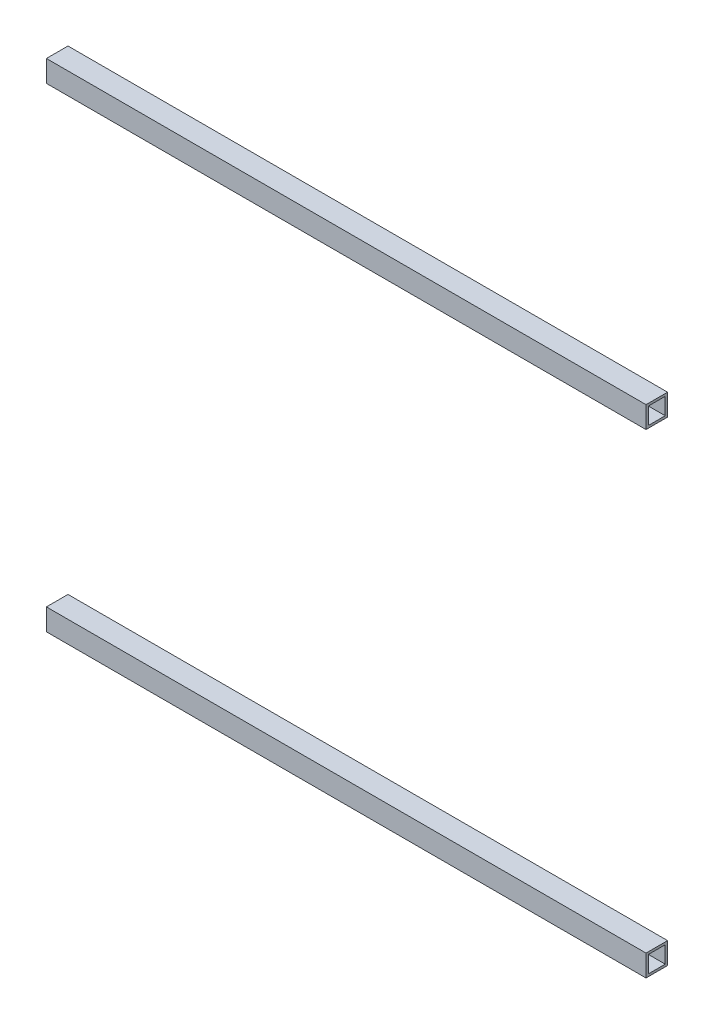
ISO-10303-21;
HEADER;
FILE_DESCRIPTION(('STEP AP214'),'2;1');
FILE_NAME('part.step','',(''),(''),'','','');
FILE_SCHEMA(('AUTOMOTIVE_DESIGN { 1 0 10303 214 1 1 1 1 }'));
ENDSEC;
DATA;
#1=APPLICATION_CONTEXT('core data for automotive mechanical design processes');
#2=APPLICATION_PROTOCOL_DEFINITION('international standard','automotive_design',2000,#1);
#3=PRODUCT_CONTEXT('',#1,'mechanical');
#4=PRODUCT('Part','Part','',(#3));
#5=PRODUCT_RELATED_PRODUCT_CATEGORY('part','',(#4));
#6=PRODUCT_DEFINITION_FORMATION('','',#4);
#7=PRODUCT_DEFINITION_CONTEXT('part definition',#1,'design');
#8=PRODUCT_DEFINITION('design','',#6,#7);
#9=PRODUCT_DEFINITION_SHAPE('','',#8);
#10=(LENGTH_UNIT() NAMED_UNIT(*) SI_UNIT(.MILLI.,.METRE.));
#11=(NAMED_UNIT(*) PLANE_ANGLE_UNIT() SI_UNIT($,.RADIAN.));
#12=(NAMED_UNIT(*) SI_UNIT($,.STERADIAN.) SOLID_ANGLE_UNIT());
#13=UNCERTAINTY_MEASURE_WITH_UNIT(LENGTH_MEASURE(1.E-05),#10,'distance_accuracy_value','');
#14=(GEOMETRIC_REPRESENTATION_CONTEXT(3) GLOBAL_UNCERTAINTY_ASSIGNED_CONTEXT((#13)) GLOBAL_UNIT_ASSIGNED_CONTEXT((#10,
#11,#12)) REPRESENTATION_CONTEXT('',''));
#15=CARTESIAN_POINT('',(0.,0.,0.));
#16=DIRECTION('',(0.,0.,1.));
#17=DIRECTION('',(1.,0.,0.));
#18=AXIS2_PLACEMENT_3D('',#15,#16,#17);
#19=CARTESIAN_POINT('',(529.05,9.52500000000001,9.52500000000002));
#20=DIRECTION('',(0.,-1.,0.));
#21=DIRECTION('',(0.,0.,-1.));
#22=AXIS2_PLACEMENT_3D('',#19,#20,#21);
#23=PLANE('',#22);
#24=DIRECTION('',(0.,0.,1.));
#25=VECTOR('',#24,1.);
#26=CARTESIAN_POINT('',(0.,9.52500000000001,9.52500000000002));
#27=LINE('',#26,#25);
#28=CARTESIAN_POINT('',(0.,9.52500000000001,-9.52500000000003));
#29=VERTEX_POINT('',#28);
#30=CARTESIAN_POINT('',(0.,9.52500000000001,9.52500000000002));
#31=VERTEX_POINT('',#30);
#32=EDGE_CURVE('E171',#29,#31,#27,.T.);
#33=ORIENTED_EDGE('',*,*,#32,.T.);
#34=DIRECTION('',(-1.,0.,0.));
#35=VECTOR('',#34,1.);
#36=CARTESIAN_POINT('',(529.05,9.52500000000001,9.52500000000002));
#37=LINE('',#36,#35);
#38=CARTESIAN_POINT('',(529.05,9.52500000000001,9.52500000000002));
#39=VERTEX_POINT('',#38);
#40=EDGE_CURVE('E13',#39,#31,#37,.T.);
#41=ORIENTED_EDGE('',*,*,#40,.F.);
#42=DIRECTION('',(0.,0.,1.));
#43=VECTOR('',#42,1.);
#44=CARTESIAN_POINT('',(529.05,9.52500000000001,9.52500000000002));
#45=LINE('',#44,#43);
#46=CARTESIAN_POINT('',(529.05,9.52500000000001,-9.52500000000003));
#47=VERTEX_POINT('',#46);
#48=EDGE_CURVE('E145',#47,#39,#45,.T.);
#49=ORIENTED_EDGE('',*,*,#48,.F.);
#50=DIRECTION('',(-1.,0.,0.));
#51=VECTOR('',#50,1.);
#52=CARTESIAN_POINT('',(529.05,9.52500000000001,-9.52500000000003));
#53=LINE('',#52,#51);
#54=EDGE_CURVE('E178',#47,#29,#53,.T.);
#55=ORIENTED_EDGE('',*,*,#54,.T.);
#56=EDGE_LOOP('',(#33,#41,#49,#55));
#57=FACE_BOUND('',#56,.T.);
#58=ADVANCED_FACE('F64',(#57),#23,.F.);
#59=CARTESIAN_POINT('',(529.05,9.52500000000001,9.52500000000002));
#60=DIRECTION('',(0.,0.,-1.));
#61=DIRECTION('',(-1.,0.,0.));
#62=AXIS2_PLACEMENT_3D('',#59,#60,#61);
#63=PLANE('',#62);
#64=DIRECTION('',(0.,-1.,0.));
#65=VECTOR('',#64,1.);
#66=CARTESIAN_POINT('',(0.,9.52500000000001,9.52500000000002));
#67=LINE('',#66,#65);
#68=CARTESIAN_POINT('',(0.,-9.52500000000001,9.52500000000002));
#69=VERTEX_POINT('',#68);
#70=EDGE_CURVE('E150',#31,#69,#67,.T.);
#71=ORIENTED_EDGE('',*,*,#70,.T.);
#72=DIRECTION('',(-1.,0.,0.));
#73=VECTOR('',#72,1.);
#74=CARTESIAN_POINT('',(529.05,-9.52500000000001,9.52500000000002));
#75=LINE('',#74,#73);
#76=CARTESIAN_POINT('',(529.05,-9.52500000000001,9.52500000000002));
#77=VERTEX_POINT('',#76);
#78=EDGE_CURVE('E74',#77,#69,#75,.T.);
#79=ORIENTED_EDGE('',*,*,#78,.F.);
#80=DIRECTION('',(0.,-1.,0.));
#81=VECTOR('',#80,1.);
#82=CARTESIAN_POINT('',(529.05,9.52500000000001,9.52500000000002));
#83=LINE('',#82,#81);
#84=EDGE_CURVE('E139',#39,#77,#83,.T.);
#85=ORIENTED_EDGE('',*,*,#84,.F.);
#86=ORIENTED_EDGE('',*,*,#40,.T.);
#87=EDGE_LOOP('',(#71,#79,#85,#86));
#88=FACE_BOUND('',#87,.T.);
#89=ADVANCED_FACE('F149',(#88),#63,.F.);
#90=CARTESIAN_POINT('',(529.05,-9.52500000000001,-9.52500000000003));
#91=DIRECTION('',(0.,1.,0.));
#92=DIRECTION('',(0.,0.,1.));
#93=AXIS2_PLACEMENT_3D('',#90,#91,#92);
#94=PLANE('',#93);
#95=DIRECTION('',(0.,0.,-1.));
#96=VECTOR('',#95,1.);
#97=CARTESIAN_POINT('',(0.,-9.52500000000001,-9.52500000000003));
#98=LINE('',#97,#96);
#99=CARTESIAN_POINT('',(0.,-9.52500000000001,-9.52500000000003));
#100=VERTEX_POINT('',#99);
#101=EDGE_CURVE('E112',#69,#100,#98,.T.);
#102=ORIENTED_EDGE('',*,*,#101,.T.);
#103=DIRECTION('',(-1.,0.,0.));
#104=VECTOR('',#103,1.);
#105=CARTESIAN_POINT('',(529.05,-9.52500000000001,-9.52500000000003));
#106=LINE('',#105,#104);
#107=CARTESIAN_POINT('',(529.05,-9.52500000000001,-9.52500000000003));
#108=VERTEX_POINT('',#107);
#109=EDGE_CURVE('E151',#108,#100,#106,.T.);
#110=ORIENTED_EDGE('',*,*,#109,.F.);
#111=DIRECTION('',(0.,0.,-1.));
#112=VECTOR('',#111,1.);
#113=CARTESIAN_POINT('',(529.05,-9.52500000000001,-9.52500000000003));
#114=LINE('',#113,#112);
#115=EDGE_CURVE('E143',#77,#108,#114,.T.);
#116=ORIENTED_EDGE('',*,*,#115,.F.);
#117=ORIENTED_EDGE('',*,*,#78,.T.);
#118=EDGE_LOOP('',(#102,#110,#116,#117));
#119=FACE_BOUND('',#118,.T.);
#120=ADVANCED_FACE('F153',(#119),#94,.F.);
#121=CARTESIAN_POINT('',(529.05,7.4168,7.41680000000001));
#122=DIRECTION('',(0.,0.,-1.));
#123=DIRECTION('',(-1.,0.,0.));
#124=AXIS2_PLACEMENT_3D('',#121,#122,#123);
#125=PLANE('',#124);
#126=DIRECTION('',(0.,-1.,0.));
#127=VECTOR('',#126,1.);
#128=CARTESIAN_POINT('',(0.,7.4168,7.41680000000001));
#129=LINE('',#128,#127);
#130=CARTESIAN_POINT('',(0.,7.4168,7.41680000000001));
#131=VERTEX_POINT('',#130);
#132=CARTESIAN_POINT('',(0.,-7.4168,7.41680000000001));
#133=VERTEX_POINT('',#132);
#134=EDGE_CURVE('E159',#131,#133,#129,.T.);
#135=ORIENTED_EDGE('',*,*,#134,.F.);
#136=DIRECTION('',(-1.,0.,0.));
#137=VECTOR('',#136,1.);
#138=CARTESIAN_POINT('',(529.05,7.4168,7.41680000000001));
#139=LINE('',#138,#137);
#140=CARTESIAN_POINT('',(529.05,7.4168,7.41680000000001));
#141=VERTEX_POINT('',#140);
#142=EDGE_CURVE('E68',#141,#131,#139,.T.);
#143=ORIENTED_EDGE('',*,*,#142,.F.);
#144=DIRECTION('',(0.,-1.,0.));
#145=VECTOR('',#144,1.);
#146=CARTESIAN_POINT('',(529.05,7.4168,7.41680000000001));
#147=LINE('',#146,#145);
#148=CARTESIAN_POINT('',(529.05,-7.4168,7.41680000000001));
#149=VERTEX_POINT('',#148);
#150=EDGE_CURVE('E177',#141,#149,#147,.T.);
#151=ORIENTED_EDGE('',*,*,#150,.T.);
#152=DIRECTION('',(-1.,0.,0.));
#153=VECTOR('',#152,1.);
#154=CARTESIAN_POINT('',(529.05,-7.4168,7.41680000000001));
#155=LINE('',#154,#153);
#156=EDGE_CURVE('E155',#149,#133,#155,.T.);
#157=ORIENTED_EDGE('',*,*,#156,.T.);
#158=EDGE_LOOP('',(#135,#143,#151,#157));
#159=FACE_BOUND('',#158,.T.);
#160=ADVANCED_FACE('F66',(#159),#125,.T.);
#161=CARTESIAN_POINT('',(529.05,7.4168,7.41680000000001));
#162=DIRECTION('',(0.,-1.,0.));
#163=DIRECTION('',(0.,0.,-1.));
#164=AXIS2_PLACEMENT_3D('',#161,#162,#163);
#165=PLANE('',#164);
#166=DIRECTION('',(0.,0.,1.));
#167=VECTOR('',#166,1.);
#168=CARTESIAN_POINT('',(0.,7.4168,7.41680000000001));
#169=LINE('',#168,#167);
#170=CARTESIAN_POINT('',(0.,7.4168,-7.41680000000002));
#171=VERTEX_POINT('',#170);
#172=EDGE_CURVE('E162',#171,#131,#169,.T.);
#173=ORIENTED_EDGE('',*,*,#172,.F.);
#174=DIRECTION('',(-1.,0.,0.));
#175=VECTOR('',#174,1.);
#176=CARTESIAN_POINT('',(529.05,7.4168,-7.41680000000002));
#177=LINE('',#176,#175);
#178=CARTESIAN_POINT('',(529.05,7.4168,-7.41680000000002));
#179=VERTEX_POINT('',#178);
#180=EDGE_CURVE('E183',#179,#171,#177,.T.);
#181=ORIENTED_EDGE('',*,*,#180,.F.);
#182=DIRECTION('',(0.,0.,1.));
#183=VECTOR('',#182,1.);
#184=CARTESIAN_POINT('',(529.05,7.4168,7.41680000000001));
#185=LINE('',#184,#183);
#186=EDGE_CURVE('E192',#179,#141,#185,.T.);
#187=ORIENTED_EDGE('',*,*,#186,.T.);
#188=ORIENTED_EDGE('',*,*,#142,.T.);
#189=EDGE_LOOP('',(#173,#181,#187,#188));
#190=FACE_BOUND('',#189,.T.);
#191=ADVANCED_FACE('F190',(#190),#165,.T.);
#192=CARTESIAN_POINT('',(529.05,-7.4168,-7.41680000000002));
#193=DIRECTION('',(0.,0.,1.));
#194=DIRECTION('',(1.,0.,0.));
#195=AXIS2_PLACEMENT_3D('',#192,#193,#194);
#196=PLANE('',#195);
#197=DIRECTION('',(0.,1.,0.));
#198=VECTOR('',#197,1.);
#199=CARTESIAN_POINT('',(0.,-7.4168,-7.41680000000002));
#200=LINE('',#199,#198);
#201=CARTESIAN_POINT('',(0.,-7.4168,-7.41680000000002));
#202=VERTEX_POINT('',#201);
#203=EDGE_CURVE('E165',#202,#171,#200,.T.);
#204=ORIENTED_EDGE('',*,*,#203,.F.);
#205=DIRECTION('',(-1.,0.,0.));
#206=VECTOR('',#205,1.);
#207=CARTESIAN_POINT('',(529.05,-7.4168,-7.41680000000002));
#208=LINE('',#207,#206);
#209=CARTESIAN_POINT('',(529.05,-7.4168,-7.41680000000002));
#210=VERTEX_POINT('',#209);
#211=EDGE_CURVE('E182',#210,#202,#208,.T.);
#212=ORIENTED_EDGE('',*,*,#211,.F.);
#213=DIRECTION('',(0.,1.,0.));
#214=VECTOR('',#213,1.);
#215=CARTESIAN_POINT('',(529.05,-7.4168,-7.41680000000002));
#216=LINE('',#215,#214);
#217=EDGE_CURVE('E199',#210,#179,#216,.T.);
#218=ORIENTED_EDGE('',*,*,#217,.T.);
#219=ORIENTED_EDGE('',*,*,#180,.T.);
#220=EDGE_LOOP('',(#204,#212,#218,#219));
#221=FACE_BOUND('',#220,.T.);
#222=ADVANCED_FACE('F197',(#221),#196,.T.);
#223=CARTESIAN_POINT('',(529.05,-7.4168,-7.41680000000002));
#224=DIRECTION('',(0.,1.,0.));
#225=DIRECTION('',(0.,0.,1.));
#226=AXIS2_PLACEMENT_3D('',#223,#224,#225);
#227=PLANE('',#226);
#228=DIRECTION('',(0.,0.,-1.));
#229=VECTOR('',#228,1.);
#230=CARTESIAN_POINT('',(0.,-7.4168,-7.41680000000002));
#231=LINE('',#230,#229);
#232=EDGE_CURVE('E168',#133,#202,#231,.T.);
#233=ORIENTED_EDGE('',*,*,#232,.F.);
#234=ORIENTED_EDGE('',*,*,#156,.F.);
#235=DIRECTION('',(0.,0.,-1.));
#236=VECTOR('',#235,1.);
#237=CARTESIAN_POINT('',(529.05,-7.4168,-7.41680000000002));
#238=LINE('',#237,#236);
#239=EDGE_CURVE('E204',#149,#210,#238,.T.);
#240=ORIENTED_EDGE('',*,*,#239,.T.);
#241=ORIENTED_EDGE('',*,*,#211,.T.);
#242=EDGE_LOOP('',(#233,#234,#240,#241));
#243=FACE_BOUND('',#242,.T.);
#244=ADVANCED_FACE('F206',(#243),#227,.T.);
#245=CARTESIAN_POINT('',(529.05,-9.52500000000001,-9.52500000000003));
#246=DIRECTION('',(0.,0.,1.));
#247=DIRECTION('',(1.,0.,0.));
#248=AXIS2_PLACEMENT_3D('',#245,#246,#247);
#249=PLANE('',#248);
#250=DIRECTION('',(0.,1.,0.));
#251=VECTOR('',#250,1.);
#252=CARTESIAN_POINT('',(0.,-9.52500000000001,-9.52500000000003));
#253=LINE('',#252,#251);
#254=EDGE_CURVE('E118',#100,#29,#253,.T.);
#255=ORIENTED_EDGE('',*,*,#254,.T.);
#256=ORIENTED_EDGE('',*,*,#54,.F.);
#257=DIRECTION('',(0.,1.,0.));
#258=VECTOR('',#257,1.);
#259=CARTESIAN_POINT('',(529.05,-9.52500000000001,-9.52500000000003));
#260=LINE('',#259,#258);
#261=EDGE_CURVE('E83',#108,#47,#260,.T.);
#262=ORIENTED_EDGE('',*,*,#261,.F.);
#263=ORIENTED_EDGE('',*,*,#109,.T.);
#264=EDGE_LOOP('',(#255,#256,#262,#263));
#265=FACE_BOUND('',#264,.T.);
#266=ADVANCED_FACE('F211',(#265),#249,.F.);
#267=CARTESIAN_POINT('',(529.05,-419.05,0.));
#268=DIRECTION('',(1.,0.,0.));
#269=DIRECTION('',(0.,0.,-1.));
#270=AXIS2_PLACEMENT_3D('',#267,#268,#269);
#271=PLANE('',#270);
#272=ORIENTED_EDGE('',*,*,#150,.F.);
#273=ORIENTED_EDGE('',*,*,#186,.F.);
#274=ORIENTED_EDGE('',*,*,#217,.F.);
#275=ORIENTED_EDGE('',*,*,#239,.F.);
#276=EDGE_LOOP('',(#272,#273,#274,#275));
#277=FACE_BOUND('',#276,.T.);
#278=ORIENTED_EDGE('',*,*,#48,.T.);
#279=ORIENTED_EDGE('',*,*,#84,.T.);
#280=ORIENTED_EDGE('',*,*,#115,.T.);
#281=ORIENTED_EDGE('',*,*,#261,.T.);
#282=EDGE_LOOP('',(#278,#279,#280,#281));
#283=FACE_BOUND('',#282,.T.);
#284=ADVANCED_FACE('F141',(#277,#283),#271,.T.);
#285=CARTESIAN_POINT('',(0.,-419.05,0.));
#286=DIRECTION('',(1.,0.,0.));
#287=DIRECTION('',(0.,0.,-1.));
#288=AXIS2_PLACEMENT_3D('',#285,#286,#287);
#289=PLANE('',#288);
#290=ORIENTED_EDGE('',*,*,#134,.T.);
#291=ORIENTED_EDGE('',*,*,#232,.T.);
#292=ORIENTED_EDGE('',*,*,#203,.T.);
#293=ORIENTED_EDGE('',*,*,#172,.T.);
#294=EDGE_LOOP('',(#290,#291,#292,#293));
#295=FACE_BOUND('',#294,.T.);
#296=ORIENTED_EDGE('',*,*,#32,.F.);
#297=ORIENTED_EDGE('',*,*,#254,.F.);
#298=ORIENTED_EDGE('',*,*,#101,.F.);
#299=ORIENTED_EDGE('',*,*,#70,.F.);
#300=EDGE_LOOP('',(#296,#297,#298,#299));
#301=FACE_BOUND('',#300,.T.);
#302=ADVANCED_FACE('F195',(#295,#301),#289,.F.);
#303=CLOSED_SHELL('',(#58,#89,#120,#160,#191,#222,#244,#266,#284,#302));
#304=MANIFOLD_SOLID_BREP('B2',#303);
#305=CARTESIAN_POINT('',(529.05,428.575,9.52500000000002));
#306=DIRECTION('',(0.,-1.,0.));
#307=DIRECTION('',(0.,0.,-1.));
#308=AXIS2_PLACEMENT_3D('',#305,#306,#307);
#309=PLANE('',#308);
#310=DIRECTION('',(0.,0.,1.));
#311=VECTOR('',#310,1.);
#312=CARTESIAN_POINT('',(0.,428.575,9.52500000000002));
#313=LINE('',#312,#311);
#314=CARTESIAN_POINT('',(0.,428.575,-9.52500000000003));
#315=VERTEX_POINT('',#314);
#316=CARTESIAN_POINT('',(0.,428.575,9.52500000000002));
#317=VERTEX_POINT('',#316);
#318=EDGE_CURVE('E440',#315,#317,#313,.T.);
#319=ORIENTED_EDGE('',*,*,#318,.T.);
#320=DIRECTION('',(-1.,0.,0.));
#321=VECTOR('',#320,1.);
#322=CARTESIAN_POINT('',(529.05,428.575,9.52500000000002));
#323=LINE('',#322,#321);
#324=CARTESIAN_POINT('',(529.05,428.575,9.52500000000002));
#325=VERTEX_POINT('',#324);
#326=EDGE_CURVE('E62',#325,#317,#323,.T.);
#327=ORIENTED_EDGE('',*,*,#326,.F.);
#328=DIRECTION('',(0.,0.,1.));
#329=VECTOR('',#328,1.);
#330=CARTESIAN_POINT('',(529.05,428.575,9.52500000000002));
#331=LINE('',#330,#329);
#332=CARTESIAN_POINT('',(529.05,428.575,-9.52500000000003));
#333=VERTEX_POINT('',#332);
#334=EDGE_CURVE('E414',#333,#325,#331,.T.);
#335=ORIENTED_EDGE('',*,*,#334,.F.);
#336=DIRECTION('',(-1.,0.,0.));
#337=VECTOR('',#336,1.);
#338=CARTESIAN_POINT('',(529.05,428.575,-9.52500000000003));
#339=LINE('',#338,#337);
#340=EDGE_CURVE('E447',#333,#315,#339,.T.);
#341=ORIENTED_EDGE('',*,*,#340,.T.);
#342=EDGE_LOOP('',(#319,#327,#335,#341));
#343=FACE_BOUND('',#342,.T.);
#344=ADVANCED_FACE('F333',(#343),#309,.F.);
#345=CARTESIAN_POINT('',(529.05,428.575,9.52500000000002));
#346=DIRECTION('',(0.,0.,-1.));
#347=DIRECTION('',(-1.,0.,0.));
#348=AXIS2_PLACEMENT_3D('',#345,#346,#347);
#349=PLANE('',#348);
#350=DIRECTION('',(0.,-1.,0.));
#351=VECTOR('',#350,1.);
#352=CARTESIAN_POINT('',(0.,428.575,9.52500000000002));
#353=LINE('',#352,#351);
#354=CARTESIAN_POINT('',(0.,409.525,9.52500000000002));
#355=VERTEX_POINT('',#354);
#356=EDGE_CURVE('E419',#317,#355,#353,.T.);
#357=ORIENTED_EDGE('',*,*,#356,.T.);
#358=DIRECTION('',(-1.,0.,0.));
#359=VECTOR('',#358,1.);
#360=CARTESIAN_POINT('',(529.05,409.525,9.52500000000002));
#361=LINE('',#360,#359);
#362=CARTESIAN_POINT('',(529.05,409.525,9.52500000000002));
#363=VERTEX_POINT('',#362);
#364=EDGE_CURVE('E343',#363,#355,#361,.T.);
#365=ORIENTED_EDGE('',*,*,#364,.F.);
#366=DIRECTION('',(0.,-1.,0.));
#367=VECTOR('',#366,1.);
#368=CARTESIAN_POINT('',(529.05,428.575,9.52500000000002));
#369=LINE('',#368,#367);
#370=EDGE_CURVE('E408',#325,#363,#369,.T.);
#371=ORIENTED_EDGE('',*,*,#370,.F.);
#372=ORIENTED_EDGE('',*,*,#326,.T.);
#373=EDGE_LOOP('',(#357,#365,#371,#372));
#374=FACE_BOUND('',#373,.T.);
#375=ADVANCED_FACE('F418',(#374),#349,.F.);
#376=CARTESIAN_POINT('',(529.05,409.525,-9.52500000000003));
#377=DIRECTION('',(0.,1.,0.));
#378=DIRECTION('',(0.,0.,1.));
#379=AXIS2_PLACEMENT_3D('',#376,#377,#378);
#380=PLANE('',#379);
#381=DIRECTION('',(0.,0.,-1.));
#382=VECTOR('',#381,1.);
#383=CARTESIAN_POINT('',(0.,409.525,-9.52500000000003));
#384=LINE('',#383,#382);
#385=CARTESIAN_POINT('',(0.,409.525,-9.52500000000003));
#386=VERTEX_POINT('',#385);
#387=EDGE_CURVE('E381',#355,#386,#384,.T.);
#388=ORIENTED_EDGE('',*,*,#387,.T.);
#389=DIRECTION('',(-1.,0.,0.));
#390=VECTOR('',#389,1.);
#391=CARTESIAN_POINT('',(529.05,409.525,-9.52500000000003));
#392=LINE('',#391,#390);
#393=CARTESIAN_POINT('',(529.05,409.525,-9.52500000000003));
#394=VERTEX_POINT('',#393);
#395=EDGE_CURVE('E420',#394,#386,#392,.T.);
#396=ORIENTED_EDGE('',*,*,#395,.F.);
#397=DIRECTION('',(0.,0.,-1.));
#398=VECTOR('',#397,1.);
#399=CARTESIAN_POINT('',(529.05,409.525,-9.52500000000003));
#400=LINE('',#399,#398);
#401=EDGE_CURVE('E412',#363,#394,#400,.T.);
#402=ORIENTED_EDGE('',*,*,#401,.F.);
#403=ORIENTED_EDGE('',*,*,#364,.T.);
#404=EDGE_LOOP('',(#388,#396,#402,#403));
#405=FACE_BOUND('',#404,.T.);
#406=ADVANCED_FACE('F422',(#405),#380,.F.);
#407=CARTESIAN_POINT('',(529.05,426.4668,7.41680000000001));
#408=DIRECTION('',(0.,0.,-1.));
#409=DIRECTION('',(-1.,0.,0.));
#410=AXIS2_PLACEMENT_3D('',#407,#408,#409);
#411=PLANE('',#410);
#412=DIRECTION('',(0.,-1.,0.));
#413=VECTOR('',#412,1.);
#414=CARTESIAN_POINT('',(0.,426.4668,7.41680000000001));
#415=LINE('',#414,#413);
#416=CARTESIAN_POINT('',(0.,426.4668,7.41680000000001));
#417=VERTEX_POINT('',#416);
#418=CARTESIAN_POINT('',(0.,411.6332,7.41680000000001));
#419=VERTEX_POINT('',#418);
#420=EDGE_CURVE('E428',#417,#419,#415,.T.);
#421=ORIENTED_EDGE('',*,*,#420,.F.);
#422=DIRECTION('',(-1.,0.,0.));
#423=VECTOR('',#422,1.);
#424=CARTESIAN_POINT('',(529.05,426.4668,7.41680000000001));
#425=LINE('',#424,#423);
#426=CARTESIAN_POINT('',(529.05,426.4668,7.41680000000001));
#427=VERTEX_POINT('',#426);
#428=EDGE_CURVE('E337',#427,#417,#425,.T.);
#429=ORIENTED_EDGE('',*,*,#428,.F.);
#430=DIRECTION('',(0.,-1.,0.));
#431=VECTOR('',#430,1.);
#432=CARTESIAN_POINT('',(529.05,426.4668,7.41680000000001));
#433=LINE('',#432,#431);
#434=CARTESIAN_POINT('',(529.05,411.6332,7.41680000000001));
#435=VERTEX_POINT('',#434);
#436=EDGE_CURVE('E446',#427,#435,#433,.T.);
#437=ORIENTED_EDGE('',*,*,#436,.T.);
#438=DIRECTION('',(-1.,0.,0.));
#439=VECTOR('',#438,1.);
#440=CARTESIAN_POINT('',(529.05,411.6332,7.41680000000001));
#441=LINE('',#440,#439);
#442=EDGE_CURVE('E424',#435,#419,#441,.T.);
#443=ORIENTED_EDGE('',*,*,#442,.T.);
#444=EDGE_LOOP('',(#421,#429,#437,#443));
#445=FACE_BOUND('',#444,.T.);
#446=ADVANCED_FACE('F335',(#445),#411,.T.);
#447=CARTESIAN_POINT('',(529.05,426.4668,7.41680000000001));
#448=DIRECTION('',(0.,-1.,0.));
#449=DIRECTION('',(0.,0.,-1.));
#450=AXIS2_PLACEMENT_3D('',#447,#448,#449);
#451=PLANE('',#450);
#452=DIRECTION('',(0.,0.,1.));
#453=VECTOR('',#452,1.);
#454=CARTESIAN_POINT('',(0.,426.4668,7.41680000000001));
#455=LINE('',#454,#453);
#456=CARTESIAN_POINT('',(0.,426.4668,-7.41680000000002));
#457=VERTEX_POINT('',#456);
#458=EDGE_CURVE('E431',#457,#417,#455,.T.);
#459=ORIENTED_EDGE('',*,*,#458,.F.);
#460=DIRECTION('',(-1.,0.,0.));
#461=VECTOR('',#460,1.);
#462=CARTESIAN_POINT('',(529.05,426.4668,-7.41680000000002));
#463=LINE('',#462,#461);
#464=CARTESIAN_POINT('',(529.05,426.4668,-7.41680000000002));
#465=VERTEX_POINT('',#464);
#466=EDGE_CURVE('E452',#465,#457,#463,.T.);
#467=ORIENTED_EDGE('',*,*,#466,.F.);
#468=DIRECTION('',(0.,0.,1.));
#469=VECTOR('',#468,1.);
#470=CARTESIAN_POINT('',(529.05,426.4668,7.41680000000001));
#471=LINE('',#470,#469);
#472=EDGE_CURVE('E461',#465,#427,#471,.T.);
#473=ORIENTED_EDGE('',*,*,#472,.T.);
#474=ORIENTED_EDGE('',*,*,#428,.T.);
#475=EDGE_LOOP('',(#459,#467,#473,#474));
#476=FACE_BOUND('',#475,.T.);
#477=ADVANCED_FACE('F459',(#476),#451,.T.);
#478=CARTESIAN_POINT('',(529.05,411.6332,-7.41680000000002));
#479=DIRECTION('',(0.,0.,1.));
#480=DIRECTION('',(1.,0.,0.));
#481=AXIS2_PLACEMENT_3D('',#478,#479,#480);
#482=PLANE('',#481);
#483=DIRECTION('',(0.,1.,0.));
#484=VECTOR('',#483,1.);
#485=CARTESIAN_POINT('',(0.,411.6332,-7.41680000000002));
#486=LINE('',#485,#484);
#487=CARTESIAN_POINT('',(0.,411.6332,-7.41680000000002));
#488=VERTEX_POINT('',#487);
#489=EDGE_CURVE('E434',#488,#457,#486,.T.);
#490=ORIENTED_EDGE('',*,*,#489,.F.);
#491=DIRECTION('',(-1.,0.,0.));
#492=VECTOR('',#491,1.);
#493=CARTESIAN_POINT('',(529.05,411.6332,-7.41680000000002));
#494=LINE('',#493,#492);
#495=CARTESIAN_POINT('',(529.05,411.6332,-7.41680000000002));
#496=VERTEX_POINT('',#495);
#497=EDGE_CURVE('E451',#496,#488,#494,.T.);
#498=ORIENTED_EDGE('',*,*,#497,.F.);
#499=DIRECTION('',(0.,1.,0.));
#500=VECTOR('',#499,1.);
#501=CARTESIAN_POINT('',(529.05,411.6332,-7.41680000000002));
#502=LINE('',#501,#500);
#503=EDGE_CURVE('E468',#496,#465,#502,.T.);
#504=ORIENTED_EDGE('',*,*,#503,.T.);
#505=ORIENTED_EDGE('',*,*,#466,.T.);
#506=EDGE_LOOP('',(#490,#498,#504,#505));
#507=FACE_BOUND('',#506,.T.);
#508=ADVANCED_FACE('F466',(#507),#482,.T.);
#509=CARTESIAN_POINT('',(529.05,411.6332,-7.41680000000002));
#510=DIRECTION('',(0.,1.,0.));
#511=DIRECTION('',(0.,0.,1.));
#512=AXIS2_PLACEMENT_3D('',#509,#510,#511);
#513=PLANE('',#512);
#514=DIRECTION('',(0.,0.,-1.));
#515=VECTOR('',#514,1.);
#516=CARTESIAN_POINT('',(0.,411.6332,-7.41680000000002));
#517=LINE('',#516,#515);
#518=EDGE_CURVE('E437',#419,#488,#517,.T.);
#519=ORIENTED_EDGE('',*,*,#518,.F.);
#520=ORIENTED_EDGE('',*,*,#442,.F.);
#521=DIRECTION('',(0.,0.,-1.));
#522=VECTOR('',#521,1.);
#523=CARTESIAN_POINT('',(529.05,411.6332,-7.41680000000002));
#524=LINE('',#523,#522);
#525=EDGE_CURVE('E473',#435,#496,#524,.T.);
#526=ORIENTED_EDGE('',*,*,#525,.T.);
#527=ORIENTED_EDGE('',*,*,#497,.T.);
#528=EDGE_LOOP('',(#519,#520,#526,#527));
#529=FACE_BOUND('',#528,.T.);
#530=ADVANCED_FACE('F475',(#529),#513,.T.);
#531=CARTESIAN_POINT('',(529.05,409.525,-9.52500000000003));
#532=DIRECTION('',(0.,0.,1.));
#533=DIRECTION('',(1.,0.,0.));
#534=AXIS2_PLACEMENT_3D('',#531,#532,#533);
#535=PLANE('',#534);
#536=DIRECTION('',(0.,1.,0.));
#537=VECTOR('',#536,1.);
#538=CARTESIAN_POINT('',(0.,409.525,-9.52500000000003));
#539=LINE('',#538,#537);
#540=EDGE_CURVE('E387',#386,#315,#539,.T.);
#541=ORIENTED_EDGE('',*,*,#540,.T.);
#542=ORIENTED_EDGE('',*,*,#340,.F.);
#543=DIRECTION('',(0.,1.,0.));
#544=VECTOR('',#543,1.);
#545=CARTESIAN_POINT('',(529.05,409.525,-9.52500000000003));
#546=LINE('',#545,#544);
#547=EDGE_CURVE('E352',#394,#333,#546,.T.);
#548=ORIENTED_EDGE('',*,*,#547,.F.);
#549=ORIENTED_EDGE('',*,*,#395,.T.);
#550=EDGE_LOOP('',(#541,#542,#548,#549));
#551=FACE_BOUND('',#550,.T.);
#552=ADVANCED_FACE('F480',(#551),#535,.F.);
#553=CARTESIAN_POINT('',(529.05,0.,0.));
#554=DIRECTION('',(1.,0.,0.));
#555=DIRECTION('',(0.,0.,-1.));
#556=AXIS2_PLACEMENT_3D('',#553,#554,#555);
#557=PLANE('',#556);
#558=ORIENTED_EDGE('',*,*,#436,.F.);
#559=ORIENTED_EDGE('',*,*,#472,.F.);
#560=ORIENTED_EDGE('',*,*,#503,.F.);
#561=ORIENTED_EDGE('',*,*,#525,.F.);
#562=EDGE_LOOP('',(#558,#559,#560,#561));
#563=FACE_BOUND('',#562,.T.);
#564=ORIENTED_EDGE('',*,*,#334,.T.);
#565=ORIENTED_EDGE('',*,*,#370,.T.);
#566=ORIENTED_EDGE('',*,*,#401,.T.);
#567=ORIENTED_EDGE('',*,*,#547,.T.);
#568=EDGE_LOOP('',(#564,#565,#566,#567));
#569=FACE_BOUND('',#568,.T.);
#570=ADVANCED_FACE('F410',(#563,#569),#557,.T.);
#571=CARTESIAN_POINT('',(0.,0.,0.));
#572=DIRECTION('',(1.,0.,0.));
#573=DIRECTION('',(0.,0.,-1.));
#574=AXIS2_PLACEMENT_3D('',#571,#572,#573);
#575=PLANE('',#574);
#576=ORIENTED_EDGE('',*,*,#420,.T.);
#577=ORIENTED_EDGE('',*,*,#518,.T.);
#578=ORIENTED_EDGE('',*,*,#489,.T.);
#579=ORIENTED_EDGE('',*,*,#458,.T.);
#580=EDGE_LOOP('',(#576,#577,#578,#579));
#581=FACE_BOUND('',#580,.T.);
#582=ORIENTED_EDGE('',*,*,#318,.F.);
#583=ORIENTED_EDGE('',*,*,#540,.F.);
#584=ORIENTED_EDGE('',*,*,#387,.F.);
#585=ORIENTED_EDGE('',*,*,#356,.F.);
#586=EDGE_LOOP('',(#582,#583,#584,#585));
#587=FACE_BOUND('',#586,.T.);
#588=ADVANCED_FACE('F464',(#581,#587),#575,.F.);
#589=CLOSED_SHELL('',(#344,#375,#406,#446,#477,#508,#530,#552,#570,#588));
#590=MANIFOLD_SOLID_BREP('B7',#589);
#591=ADVANCED_BREP_SHAPE_REPRESENTATION('',(#18,#304,#590),#14);
#592=SHAPE_DEFINITION_REPRESENTATION(#9,#591);
ENDSEC;
END-ISO-10303-21;
